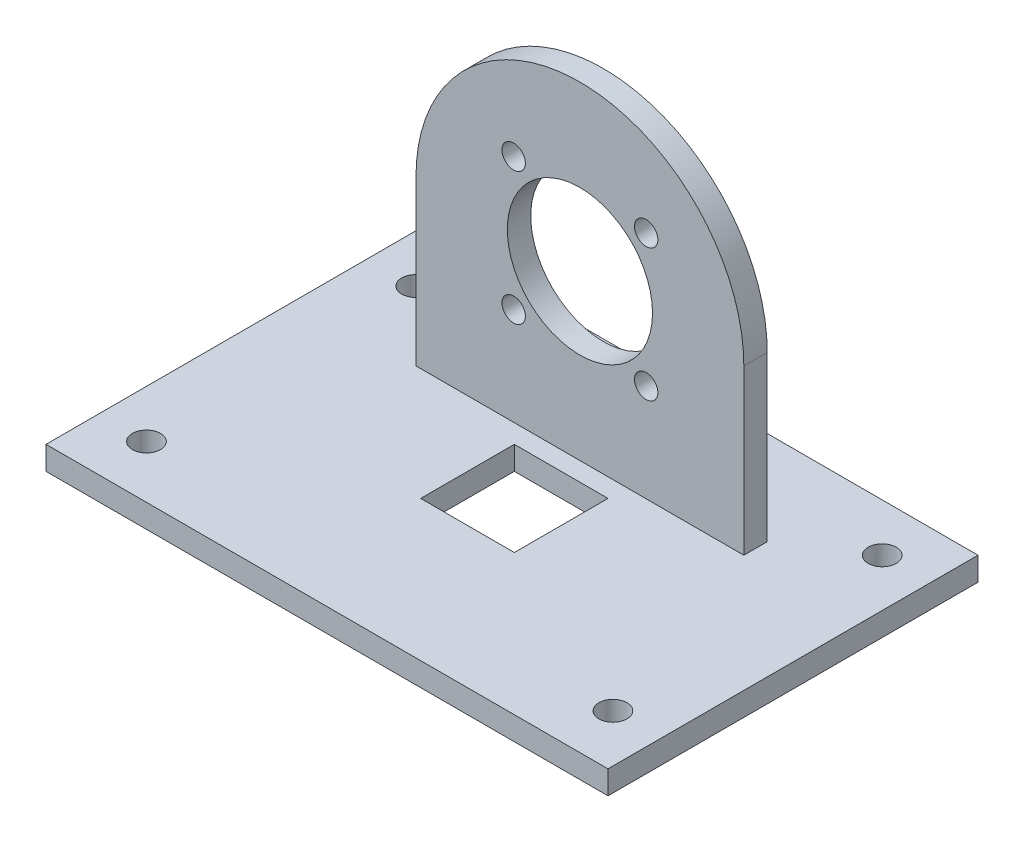
ISO-10303-21;
HEADER;
FILE_DESCRIPTION(('STEP AP214'),'2;1');
FILE_NAME('part.step','',(''),(''),'','','');
FILE_SCHEMA(('AUTOMOTIVE_DESIGN { 1 0 10303 214 1 1 1 1 }'));
ENDSEC;
DATA;
#1=APPLICATION_CONTEXT('core data for automotive mechanical design processes');
#2=APPLICATION_PROTOCOL_DEFINITION('international standard','automotive_design',2000,#1);
#3=PRODUCT_CONTEXT('',#1,'mechanical');
#4=PRODUCT('Part','Part','',(#3));
#5=PRODUCT_RELATED_PRODUCT_CATEGORY('part','',(#4));
#6=PRODUCT_DEFINITION_FORMATION('','',#4);
#7=PRODUCT_DEFINITION_CONTEXT('part definition',#1,'design');
#8=PRODUCT_DEFINITION('design','',#6,#7);
#9=PRODUCT_DEFINITION_SHAPE('','',#8);
#10=(LENGTH_UNIT() NAMED_UNIT(*) SI_UNIT(.MILLI.,.METRE.));
#11=(NAMED_UNIT(*) PLANE_ANGLE_UNIT() SI_UNIT($,.RADIAN.));
#12=(NAMED_UNIT(*) SI_UNIT($,.STERADIAN.) SOLID_ANGLE_UNIT());
#13=UNCERTAINTY_MEASURE_WITH_UNIT(LENGTH_MEASURE(1.E-05),#10,'distance_accuracy_value','');
#14=(GEOMETRIC_REPRESENTATION_CONTEXT(3) GLOBAL_UNCERTAINTY_ASSIGNED_CONTEXT((#13)) GLOBAL_UNIT_ASSIGNED_CONTEXT((#10,
#11,#12)) REPRESENTATION_CONTEXT('',''));
#15=CARTESIAN_POINT('',(0.,0.,0.));
#16=DIRECTION('',(0.,0.,1.));
#17=DIRECTION('',(1.,0.,0.));
#18=AXIS2_PLACEMENT_3D('',#15,#16,#17);
#19=CARTESIAN_POINT('',(-35.,75.,-14.));
#20=DIRECTION('',(0.,0.,-1.));
#21=DIRECTION('',(-1.,0.,0.));
#22=AXIS2_PLACEMENT_3D('',#19,#20,#21);
#23=PLANE('',#22);
#24=CARTESIAN_POINT('',(14.1421356237308,54.1421356237307,-14.));
#25=DIRECTION('',(0.,0.,-1.));
#26=DIRECTION('',(-1.,0.,0.));
#27=AXIS2_PLACEMENT_3D('',#24,#25,#26);
#28=CIRCLE('',#27,2.49999999999999);
#29=CARTESIAN_POINT('',(11.6421356237308,54.1421356237307,-14.));
#30=VERTEX_POINT('',#29);
#31=EDGE_CURVE('E606',#30,#30,#28,.F.);
#32=ORIENTED_EDGE('',*,*,#31,.F.);
#33=EDGE_LOOP('',(#32));
#34=FACE_BOUND('',#33,.T.);
#35=CARTESIAN_POINT('',(14.1421356237306,25.8578643762687,-14.));
#36=DIRECTION('',(0.,0.,-1.));
#37=DIRECTION('',(-1.,0.,0.));
#38=AXIS2_PLACEMENT_3D('',#35,#36,#37);
#39=CIRCLE('',#38,2.5);
#40=CARTESIAN_POINT('',(11.6421356237306,25.8578643762687,-14.));
#41=VERTEX_POINT('',#40);
#42=EDGE_CURVE('E616',#41,#41,#39,.F.);
#43=ORIENTED_EDGE('',*,*,#42,.F.);
#44=EDGE_LOOP('',(#43));
#45=FACE_BOUND('',#44,.T.);
#46=CARTESIAN_POINT('',(-14.1421356237313,25.857864376269,-14.));
#47=DIRECTION('',(0.,0.,-1.));
#48=DIRECTION('',(-1.,0.,0.));
#49=AXIS2_PLACEMENT_3D('',#46,#47,#48);
#50=CIRCLE('',#49,2.5);
#51=CARTESIAN_POINT('',(-16.6421356237313,25.857864376269,-14.));
#52=VERTEX_POINT('',#51);
#53=EDGE_CURVE('E622',#52,#52,#50,.F.);
#54=ORIENTED_EDGE('',*,*,#53,.F.);
#55=EDGE_LOOP('',(#54));
#56=FACE_BOUND('',#55,.T.);
#57=CARTESIAN_POINT('',(-14.1421356237309,54.142135623731,-14.));
#58=DIRECTION('',(0.,0.,-1.));
#59=DIRECTION('',(-1.,0.,0.));
#60=AXIS2_PLACEMENT_3D('',#57,#58,#59);
#61=CIRCLE('',#60,2.5);
#62=CARTESIAN_POINT('',(-16.6421356237309,54.142135623731,-14.));
#63=VERTEX_POINT('',#62);
#64=EDGE_CURVE('E165',#63,#63,#61,.F.);
#65=ORIENTED_EDGE('',*,*,#64,.F.);
#66=EDGE_LOOP('',(#65));
#67=FACE_BOUND('',#66,.T.);
#68=CARTESIAN_POINT('',(0.,40.,-14.));
#69=DIRECTION('',(0.,0.,1.));
#70=DIRECTION('',(1.,0.,0.));
#71=AXIS2_PLACEMENT_3D('',#68,#69,#70);
#72=CIRCLE('',#71,15.5);
#73=CARTESIAN_POINT('',(15.5,40.,-14.));
#74=VERTEX_POINT('',#73);
#75=EDGE_CURVE('E199',#74,#74,#72,.T.);
#76=ORIENTED_EDGE('',*,*,#75,.F.);
#77=EDGE_LOOP('',(#76));
#78=FACE_BOUND('',#77,.T.);
#79=CARTESIAN_POINT('',(0.,40.,-14.));
#80=DIRECTION('',(0.,0.,-1.));
#81=DIRECTION('',(-1.,0.,0.));
#82=AXIS2_PLACEMENT_3D('',#79,#80,#81);
#83=CIRCLE('',#82,35.0000000000001);
#84=CARTESIAN_POINT('',(-35.,40.0000023393455,-14.));
#85=VERTEX_POINT('',#84);
#86=CARTESIAN_POINT('',(35.,40.0000024370724,-14.));
#87=VERTEX_POINT('',#86);
#88=EDGE_CURVE('E210',#85,#87,#83,.T.);
#89=ORIENTED_EDGE('',*,*,#88,.F.);
#90=DIRECTION('',(0.,-1.,0.));
#91=VECTOR('',#90,1.);
#92=CARTESIAN_POINT('',(-35.,75.,-14.));
#93=LINE('',#92,#91);
#94=CARTESIAN_POINT('',(-35.,5.,-14.));
#95=VERTEX_POINT('',#94);
#96=EDGE_CURVE('E238',#85,#95,#93,.T.);
#97=ORIENTED_EDGE('',*,*,#96,.T.);
#98=DIRECTION('',(1.,0.,0.));
#99=VECTOR('',#98,1.);
#100=CARTESIAN_POINT('',(-35.,5.,-14.));
#101=LINE('',#100,#99);
#102=CARTESIAN_POINT('',(35.,5.,-14.));
#103=VERTEX_POINT('',#102);
#104=EDGE_CURVE('E217',#95,#103,#101,.T.);
#105=ORIENTED_EDGE('',*,*,#104,.T.);
#106=DIRECTION('',(0.,-1.,0.));
#107=VECTOR('',#106,1.);
#108=CARTESIAN_POINT('',(35.,75.,-14.));
#109=LINE('',#108,#107);
#110=EDGE_CURVE('E235',#87,#103,#109,.T.);
#111=ORIENTED_EDGE('',*,*,#110,.F.);
#112=EDGE_LOOP('',(#89,#97,#105,#111));
#113=FACE_BOUND('',#112,.T.);
#114=ADVANCED_FACE('F57',(#34,#45,#56,#67,#78,#113),#23,.F.);
#115=CARTESIAN_POINT('',(-35.,75.,-19.));
#116=DIRECTION('',(0.,0.,1.));
#117=DIRECTION('',(1.,0.,0.));
#118=AXIS2_PLACEMENT_3D('',#115,#116,#117);
#119=PLANE('',#118);
#120=CARTESIAN_POINT('',(14.1421356237308,54.1421356237307,-19.));
#121=DIRECTION('',(0.,0.,-1.));
#122=DIRECTION('',(-1.,0.,0.));
#123=AXIS2_PLACEMENT_3D('',#120,#121,#122);
#124=CIRCLE('',#123,2.49999999999999);
#125=CARTESIAN_POINT('',(11.6421356237308,54.1421356237307,-19.));
#126=VERTEX_POINT('',#125);
#127=EDGE_CURVE('E609',#126,#126,#124,.T.);
#128=ORIENTED_EDGE('',*,*,#127,.F.);
#129=EDGE_LOOP('',(#128));
#130=FACE_BOUND('',#129,.T.);
#131=CARTESIAN_POINT('',(14.1421356237306,25.8578643762687,-19.));
#132=DIRECTION('',(0.,0.,-1.));
#133=DIRECTION('',(-1.,0.,0.));
#134=AXIS2_PLACEMENT_3D('',#131,#132,#133);
#135=CIRCLE('',#134,2.5);
#136=CARTESIAN_POINT('',(11.6421356237306,25.8578643762687,-19.));
#137=VERTEX_POINT('',#136);
#138=EDGE_CURVE('E613',#137,#137,#135,.T.);
#139=ORIENTED_EDGE('',*,*,#138,.F.);
#140=EDGE_LOOP('',(#139));
#141=FACE_BOUND('',#140,.T.);
#142=CARTESIAN_POINT('',(-14.1421356237313,25.857864376269,-19.));
#143=DIRECTION('',(0.,0.,-1.));
#144=DIRECTION('',(-1.,0.,0.));
#145=AXIS2_PLACEMENT_3D('',#142,#143,#144);
#146=CIRCLE('',#145,2.5);
#147=CARTESIAN_POINT('',(-16.6421356237313,25.857864376269,-19.));
#148=VERTEX_POINT('',#147);
#149=EDGE_CURVE('E640',#148,#148,#146,.T.);
#150=ORIENTED_EDGE('',*,*,#149,.F.);
#151=EDGE_LOOP('',(#150));
#152=FACE_BOUND('',#151,.T.);
#153=CARTESIAN_POINT('',(-14.1421356237309,54.142135623731,-19.));
#154=DIRECTION('',(0.,0.,-1.));
#155=DIRECTION('',(-1.,0.,0.));
#156=AXIS2_PLACEMENT_3D('',#153,#154,#155);
#157=CIRCLE('',#156,2.5);
#158=CARTESIAN_POINT('',(-16.6421356237309,54.142135623731,-19.));
#159=VERTEX_POINT('',#158);
#160=EDGE_CURVE('E619',#159,#159,#157,.T.);
#161=ORIENTED_EDGE('',*,*,#160,.F.);
#162=EDGE_LOOP('',(#161));
#163=FACE_BOUND('',#162,.T.);
#164=CARTESIAN_POINT('',(0.,40.,-19.));
#165=DIRECTION('',(0.,0.,1.));
#166=DIRECTION('',(1.,0.,0.));
#167=AXIS2_PLACEMENT_3D('',#164,#165,#166);
#168=CIRCLE('',#167,15.5);
#169=CARTESIAN_POINT('',(15.5,40.,-19.));
#170=VERTEX_POINT('',#169);
#171=EDGE_CURVE('E61',#170,#170,#168,.T.);
#172=ORIENTED_EDGE('',*,*,#171,.T.);
#173=EDGE_LOOP('',(#172));
#174=FACE_BOUND('',#173,.T.);
#175=DIRECTION('',(0.,-1.,0.));
#176=VECTOR('',#175,1.);
#177=CARTESIAN_POINT('',(-35.,75.,-19.));
#178=LINE('',#177,#176);
#179=CARTESIAN_POINT('',(-35.,40.0000023393455,-19.));
#180=VERTEX_POINT('',#179);
#181=CARTESIAN_POINT('',(-35.,5.,-19.));
#182=VERTEX_POINT('',#181);
#183=EDGE_CURVE('E229',#180,#182,#178,.T.);
#184=ORIENTED_EDGE('',*,*,#183,.F.);
#185=CARTESIAN_POINT('',(0.,40.,-19.));
#186=DIRECTION('',(0.,0.,-1.));
#187=DIRECTION('',(-1.,0.,0.));
#188=AXIS2_PLACEMENT_3D('',#185,#186,#187);
#189=CIRCLE('',#188,35.0000000000001);
#190=CARTESIAN_POINT('',(35.,40.0000024370724,-19.));
#191=VERTEX_POINT('',#190);
#192=EDGE_CURVE('E203',#180,#191,#189,.T.);
#193=ORIENTED_EDGE('',*,*,#192,.T.);
#194=DIRECTION('',(0.,-1.,0.));
#195=VECTOR('',#194,1.);
#196=CARTESIAN_POINT('',(35.,75.,-19.));
#197=LINE('',#196,#195);
#198=CARTESIAN_POINT('',(35.,5.,-19.));
#199=VERTEX_POINT('',#198);
#200=EDGE_CURVE('E232',#191,#199,#197,.T.);
#201=ORIENTED_EDGE('',*,*,#200,.T.);
#202=DIRECTION('',(-1.,0.,0.));
#203=VECTOR('',#202,1.);
#204=CARTESIAN_POINT('',(-35.,5.,-19.));
#205=LINE('',#204,#203);
#206=EDGE_CURVE('E225',#199,#182,#205,.T.);
#207=ORIENTED_EDGE('',*,*,#206,.T.);
#208=EDGE_LOOP('',(#184,#193,#201,#207));
#209=FACE_BOUND('',#208,.T.);
#210=ADVANCED_FACE('F346',(#130,#141,#152,#163,#174,#209),#119,.F.);
#211=CARTESIAN_POINT('',(35.,75.,-14.));
#212=DIRECTION('',(-1.,0.,0.));
#213=DIRECTION('',(0.,0.,1.));
#214=AXIS2_PLACEMENT_3D('',#211,#212,#213);
#215=PLANE('',#214);
#216=DIRECTION('',(0.,0.,-1.));
#217=VECTOR('',#216,1.);
#218=CARTESIAN_POINT('',(35.,40.0000024370724,0.999999999999997));
#219=LINE('',#218,#217);
#220=EDGE_CURVE('E207',#87,#191,#219,.T.);
#221=ORIENTED_EDGE('',*,*,#220,.F.);
#222=ORIENTED_EDGE('',*,*,#110,.T.);
#223=DIRECTION('',(0.,0.,-1.));
#224=VECTOR('',#223,1.);
#225=CARTESIAN_POINT('',(35.,5.,-14.));
#226=LINE('',#225,#224);
#227=EDGE_CURVE('E221',#103,#199,#226,.T.);
#228=ORIENTED_EDGE('',*,*,#227,.T.);
#229=ORIENTED_EDGE('',*,*,#200,.F.);
#230=EDGE_LOOP('',(#221,#222,#228,#229));
#231=FACE_BOUND('',#230,.T.);
#232=ADVANCED_FACE('F335',(#231),#215,.F.);
#233=CARTESIAN_POINT('',(0.,5.,0.));
#234=DIRECTION('',(0.,-1.,0.));
#235=DIRECTION('',(0.,0.,-1.));
#236=AXIS2_PLACEMENT_3D('',#233,#234,#235);
#237=PLANE('',#236);
#238=DIRECTION('',(0.,0.,1.));
#239=VECTOR('',#238,1.);
#240=CARTESIAN_POINT('',(10.,5.,0.));
#241=LINE('',#240,#239);
#242=CARTESIAN_POINT('',(10.,5.,-10.));
#243=VERTEX_POINT('',#242);
#244=CARTESIAN_POINT('',(10.,5.,9.99999999999999));
#245=VERTEX_POINT('',#244);
#246=EDGE_CURVE('E181',#243,#245,#241,.T.);
#247=ORIENTED_EDGE('',*,*,#246,.T.);
#248=DIRECTION('',(-1.,0.,0.));
#249=VECTOR('',#248,1.);
#250=CARTESIAN_POINT('',(0.,5.,9.99999999999999));
#251=LINE('',#250,#249);
#252=CARTESIAN_POINT('',(-9.99999999999999,5.,9.99999999999999));
#253=VERTEX_POINT('',#252);
#254=EDGE_CURVE('E154',#245,#253,#251,.T.);
#255=ORIENTED_EDGE('',*,*,#254,.T.);
#256=DIRECTION('',(0.,0.,-1.));
#257=VECTOR('',#256,1.);
#258=CARTESIAN_POINT('',(-9.99999999999999,5.,0.));
#259=LINE('',#258,#257);
#260=CARTESIAN_POINT('',(-9.99999999999999,5.,-10.));
#261=VERTEX_POINT('',#260);
#262=EDGE_CURVE('E193',#253,#261,#259,.T.);
#263=ORIENTED_EDGE('',*,*,#262,.T.);
#264=DIRECTION('',(1.,0.,0.));
#265=VECTOR('',#264,1.);
#266=CARTESIAN_POINT('',(0.,5.,-10.));
#267=LINE('',#266,#265);
#268=EDGE_CURVE('E189',#261,#243,#267,.T.);
#269=ORIENTED_EDGE('',*,*,#268,.T.);
#270=EDGE_LOOP('',(#247,#255,#263,#269));
#271=FACE_BOUND('',#270,.T.);
#272=CARTESIAN_POINT('',(-49.7964607176049,5.,-28.7500000000006));
#273=DIRECTION('',(0.,1.,0.));
#274=DIRECTION('',(0.,0.,1.));
#275=AXIS2_PLACEMENT_3D('',#272,#273,#274);
#276=CIRCLE('',#275,3.);
#277=CARTESIAN_POINT('',(-49.7964607176049,5.,-25.7500000000006));
#278=VERTEX_POINT('',#277);
#279=EDGE_CURVE('E242',#278,#278,#276,.T.);
#280=ORIENTED_EDGE('',*,*,#279,.F.);
#281=EDGE_LOOP('',(#280));
#282=FACE_BOUND('',#281,.T.);
#283=CARTESIAN_POINT('',(-49.7964607176015,5.,28.7500000000021));
#284=DIRECTION('',(0.,1.,0.));
#285=DIRECTION('',(0.,0.,1.));
#286=AXIS2_PLACEMENT_3D('',#283,#284,#285);
#287=CIRCLE('',#286,3.);
#288=CARTESIAN_POINT('',(-49.7964607176015,5.,31.7500000000021));
#289=VERTEX_POINT('',#288);
#290=EDGE_CURVE('E250',#289,#289,#287,.T.);
#291=ORIENTED_EDGE('',*,*,#290,.F.);
#292=EDGE_LOOP('',(#291));
#293=FACE_BOUND('',#292,.T.);
#294=CARTESIAN_POINT('',(49.7964607176089,5.,28.7499999999979));
#295=DIRECTION('',(0.,1.,0.));
#296=DIRECTION('',(0.,0.,1.));
#297=AXIS2_PLACEMENT_3D('',#294,#295,#296);
#298=CIRCLE('',#297,3.);
#299=CARTESIAN_POINT('',(49.7964607176089,5.,31.7499999999979));
#300=VERTEX_POINT('',#299);
#301=EDGE_CURVE('E258',#300,#300,#298,.T.);
#302=ORIENTED_EDGE('',*,*,#301,.F.);
#303=EDGE_LOOP('',(#302));
#304=FACE_BOUND('',#303,.T.);
#305=CARTESIAN_POINT('',(49.7964607176053,5.,-28.7499999999999));
#306=DIRECTION('',(0.,1.,0.));
#307=DIRECTION('',(0.,0.,1.));
#308=AXIS2_PLACEMENT_3D('',#305,#306,#307);
#309=CIRCLE('',#308,3.);
#310=CARTESIAN_POINT('',(49.7964607176053,5.,-25.7499999999999));
#311=VERTEX_POINT('',#310);
#312=EDGE_CURVE('E266',#311,#311,#309,.T.);
#313=ORIENTED_EDGE('',*,*,#312,.F.);
#314=EDGE_LOOP('',(#313));
#315=FACE_BOUND('',#314,.T.);
#316=DIRECTION('',(1.,0.,0.));
#317=VECTOR('',#316,1.);
#318=CARTESIAN_POINT('',(-35.,5.,40.));
#319=LINE('',#318,#317);
#320=CARTESIAN_POINT('',(-60.,5.,40.));
#321=VERTEX_POINT('',#320);
#322=CARTESIAN_POINT('',(60.,5.,40.));
#323=VERTEX_POINT('',#322);
#324=EDGE_CURVE('E278',#321,#323,#319,.T.);
#325=ORIENTED_EDGE('',*,*,#324,.T.);
#326=DIRECTION('',(0.,0.,-1.));
#327=VECTOR('',#326,1.);
#328=CARTESIAN_POINT('',(60.,5.,-39.));
#329=LINE('',#328,#327);
#330=CARTESIAN_POINT('',(60.,5.,-39.));
#331=VERTEX_POINT('',#330);
#332=EDGE_CURVE('E282',#323,#331,#329,.T.);
#333=ORIENTED_EDGE('',*,*,#332,.T.);
#334=DIRECTION('',(-1.,0.,0.));
#335=VECTOR('',#334,1.);
#336=CARTESIAN_POINT('',(-60.,5.,-39.));
#337=LINE('',#336,#335);
#338=CARTESIAN_POINT('',(-60.,5.,-39.));
#339=VERTEX_POINT('',#338);
#340=EDGE_CURVE('E285',#331,#339,#337,.T.);
#341=ORIENTED_EDGE('',*,*,#340,.T.);
#342=DIRECTION('',(0.,0.,1.));
#343=VECTOR('',#342,1.);
#344=CARTESIAN_POINT('',(-60.,5.,40.));
#345=LINE('',#344,#343);
#346=EDGE_CURVE('E274',#339,#321,#345,.T.);
#347=ORIENTED_EDGE('',*,*,#346,.T.);
#348=EDGE_LOOP('',(#325,#333,#341,#347));
#349=FACE_BOUND('',#348,.T.);
#350=DIRECTION('',(0.,0.,1.));
#351=VECTOR('',#350,1.);
#352=CARTESIAN_POINT('',(-35.,5.,-19.));
#353=LINE('',#352,#351);
#354=EDGE_CURVE('E213',#182,#95,#353,.T.);
#355=ORIENTED_EDGE('',*,*,#354,.F.);
#356=ORIENTED_EDGE('',*,*,#206,.F.);
#357=ORIENTED_EDGE('',*,*,#227,.F.);
#358=ORIENTED_EDGE('',*,*,#104,.F.);
#359=EDGE_LOOP('',(#355,#356,#357,#358));
#360=FACE_BOUND('',#359,.T.);
#361=ADVANCED_FACE('F332',(#271,#282,#293,#304,#315,#349,#360),#237,.F.);
#362=CARTESIAN_POINT('',(0.,0.,0.));
#363=DIRECTION('',(0.,-1.,0.));
#364=DIRECTION('',(0.,0.,-1.));
#365=AXIS2_PLACEMENT_3D('',#362,#363,#364);
#366=PLANE('',#365);
#367=DIRECTION('',(1.,0.,0.));
#368=VECTOR('',#367,1.);
#369=CARTESIAN_POINT('',(60.,0.,40.));
#370=LINE('',#369,#368);
#371=CARTESIAN_POINT('',(-60.,0.,40.));
#372=VERTEX_POINT('',#371);
#373=CARTESIAN_POINT('',(60.,0.,40.));
#374=VERTEX_POINT('',#373);
#375=EDGE_CURVE('E292',#372,#374,#370,.T.);
#376=ORIENTED_EDGE('',*,*,#375,.F.);
#377=DIRECTION('',(0.,0.,1.));
#378=VECTOR('',#377,1.);
#379=CARTESIAN_POINT('',(-60.,0.,40.));
#380=LINE('',#379,#378);
#381=CARTESIAN_POINT('',(-60.,0.,-39.));
#382=VERTEX_POINT('',#381);
#383=EDGE_CURVE('E270',#382,#372,#380,.T.);
#384=ORIENTED_EDGE('',*,*,#383,.F.);
#385=DIRECTION('',(-1.,0.,0.));
#386=VECTOR('',#385,1.);
#387=CARTESIAN_POINT('',(-60.,0.,-39.));
#388=LINE('',#387,#386);
#389=CARTESIAN_POINT('',(60.,0.,-39.));
#390=VERTEX_POINT('',#389);
#391=EDGE_CURVE('E279',#390,#382,#388,.T.);
#392=ORIENTED_EDGE('',*,*,#391,.F.);
#393=DIRECTION('',(0.,0.,-1.));
#394=VECTOR('',#393,1.);
#395=CARTESIAN_POINT('',(60.,0.,-39.));
#396=LINE('',#395,#394);
#397=EDGE_CURVE('E295',#374,#390,#396,.T.);
#398=ORIENTED_EDGE('',*,*,#397,.F.);
#399=EDGE_LOOP('',(#376,#384,#392,#398));
#400=FACE_BOUND('',#399,.T.);
#401=DIRECTION('',(-1.,0.,0.));
#402=VECTOR('',#401,1.);
#403=CARTESIAN_POINT('',(-9.99999999999999,0.,9.99999999999999));
#404=LINE('',#403,#402);
#405=CARTESIAN_POINT('',(10.,0.,9.99999999999999));
#406=VERTEX_POINT('',#405);
#407=CARTESIAN_POINT('',(-9.99999999999999,0.,9.99999999999999));
#408=VERTEX_POINT('',#407);
#409=EDGE_CURVE('E151',#406,#408,#404,.T.);
#410=ORIENTED_EDGE('',*,*,#409,.F.);
#411=DIRECTION('',(0.,0.,1.));
#412=VECTOR('',#411,1.);
#413=CARTESIAN_POINT('',(10.,0.,-10.));
#414=LINE('',#413,#412);
#415=CARTESIAN_POINT('',(10.,0.,-10.));
#416=VERTEX_POINT('',#415);
#417=EDGE_CURVE('E160',#416,#406,#414,.T.);
#418=ORIENTED_EDGE('',*,*,#417,.F.);
#419=DIRECTION('',(1.,0.,0.));
#420=VECTOR('',#419,1.);
#421=CARTESIAN_POINT('',(-9.99999999999999,0.,-10.));
#422=LINE('',#421,#420);
#423=CARTESIAN_POINT('',(-9.99999999999999,0.,-10.));
#424=VERTEX_POINT('',#423);
#425=EDGE_CURVE('E82',#424,#416,#422,.T.);
#426=ORIENTED_EDGE('',*,*,#425,.F.);
#427=DIRECTION('',(0.,0.,-1.));
#428=VECTOR('',#427,1.);
#429=CARTESIAN_POINT('',(-9.99999999999999,0.,-10.));
#430=LINE('',#429,#428);
#431=EDGE_CURVE('E170',#408,#424,#430,.T.);
#432=ORIENTED_EDGE('',*,*,#431,.F.);
#433=EDGE_LOOP('',(#410,#418,#426,#432));
#434=FACE_BOUND('',#433,.T.);
#435=CARTESIAN_POINT('',(-49.7964607176015,0.,28.7500000000021));
#436=DIRECTION('',(0.,1.,0.));
#437=DIRECTION('',(0.,0.,1.));
#438=AXIS2_PLACEMENT_3D('',#435,#436,#437);
#439=CIRCLE('',#438,3.);
#440=CARTESIAN_POINT('',(-49.7964607176015,0.,31.7500000000021));
#441=VERTEX_POINT('',#440);
#442=EDGE_CURVE('E246',#441,#441,#439,.T.);
#443=ORIENTED_EDGE('',*,*,#442,.T.);
#444=EDGE_LOOP('',(#443));
#445=FACE_BOUND('',#444,.T.);
#446=CARTESIAN_POINT('',(49.7964607176089,0.,28.7499999999979));
#447=DIRECTION('',(0.,1.,0.));
#448=DIRECTION('',(0.,0.,1.));
#449=AXIS2_PLACEMENT_3D('',#446,#447,#448);
#450=CIRCLE('',#449,3.);
#451=CARTESIAN_POINT('',(49.7964607176089,0.,31.7499999999979));
#452=VERTEX_POINT('',#451);
#453=EDGE_CURVE('E254',#452,#452,#450,.T.);
#454=ORIENTED_EDGE('',*,*,#453,.T.);
#455=EDGE_LOOP('',(#454));
#456=FACE_BOUND('',#455,.T.);
#457=CARTESIAN_POINT('',(49.7964607176053,0.,-28.7499999999999));
#458=DIRECTION('',(0.,1.,0.));
#459=DIRECTION('',(0.,0.,1.));
#460=AXIS2_PLACEMENT_3D('',#457,#458,#459);
#461=CIRCLE('',#460,3.);
#462=CARTESIAN_POINT('',(49.7964607176053,0.,-25.7499999999999));
#463=VERTEX_POINT('',#462);
#464=EDGE_CURVE('E262',#463,#463,#461,.T.);
#465=ORIENTED_EDGE('',*,*,#464,.T.);
#466=EDGE_LOOP('',(#465));
#467=FACE_BOUND('',#466,.T.);
#468=CARTESIAN_POINT('',(-49.7964607176049,0.,-28.7500000000006));
#469=DIRECTION('',(0.,1.,0.));
#470=DIRECTION('',(0.,0.,1.));
#471=AXIS2_PLACEMENT_3D('',#468,#469,#470);
#472=CIRCLE('',#471,3.);
#473=CARTESIAN_POINT('',(-49.7964607176049,0.,-25.7500000000006));
#474=VERTEX_POINT('',#473);
#475=EDGE_CURVE('E241',#474,#474,#472,.T.);
#476=ORIENTED_EDGE('',*,*,#475,.T.);
#477=EDGE_LOOP('',(#476));
#478=FACE_BOUND('',#477,.T.);
#479=ADVANCED_FACE('F167',(#400,#434,#445,#456,#467,#478),#366,.T.);
#480=CARTESIAN_POINT('',(-60.,5.,40.));
#481=DIRECTION('',(1.,0.,0.));
#482=DIRECTION('',(0.,0.,-1.));
#483=AXIS2_PLACEMENT_3D('',#480,#481,#482);
#484=PLANE('',#483);
#485=ORIENTED_EDGE('',*,*,#383,.T.);
#486=DIRECTION('',(0.,-1.,0.));
#487=VECTOR('',#486,1.);
#488=CARTESIAN_POINT('',(-60.,5.,40.));
#489=LINE('',#488,#487);
#490=EDGE_CURVE('E67',#321,#372,#489,.T.);
#491=ORIENTED_EDGE('',*,*,#490,.F.);
#492=ORIENTED_EDGE('',*,*,#346,.F.);
#493=DIRECTION('',(0.,-1.,0.));
#494=VECTOR('',#493,1.);
#495=CARTESIAN_POINT('',(-60.,5.,-39.));
#496=LINE('',#495,#494);
#497=EDGE_CURVE('E288',#339,#382,#496,.T.);
#498=ORIENTED_EDGE('',*,*,#497,.T.);
#499=EDGE_LOOP('',(#485,#491,#492,#498));
#500=FACE_BOUND('',#499,.T.);
#501=ADVANCED_FACE('F59',(#500),#484,.F.);
#502=CARTESIAN_POINT('',(60.,5.,40.));
#503=DIRECTION('',(0.,0.,-1.));
#504=DIRECTION('',(-1.,0.,0.));
#505=AXIS2_PLACEMENT_3D('',#502,#503,#504);
#506=PLANE('',#505);
#507=ORIENTED_EDGE('',*,*,#375,.T.);
#508=DIRECTION('',(0.,-1.,0.));
#509=VECTOR('',#508,1.);
#510=CARTESIAN_POINT('',(60.,5.,40.));
#511=LINE('',#510,#509);
#512=EDGE_CURVE('E307',#323,#374,#511,.T.);
#513=ORIENTED_EDGE('',*,*,#512,.F.);
#514=ORIENTED_EDGE('',*,*,#324,.F.);
#515=ORIENTED_EDGE('',*,*,#490,.T.);
#516=EDGE_LOOP('',(#507,#513,#514,#515));
#517=FACE_BOUND('',#516,.T.);
#518=ADVANCED_FACE('F315',(#517),#506,.F.);
#519=CARTESIAN_POINT('',(60.,5.,-39.));
#520=DIRECTION('',(-1.,0.,0.));
#521=DIRECTION('',(0.,0.,1.));
#522=AXIS2_PLACEMENT_3D('',#519,#520,#521);
#523=PLANE('',#522);
#524=ORIENTED_EDGE('',*,*,#397,.T.);
#525=DIRECTION('',(0.,-1.,0.));
#526=VECTOR('',#525,1.);
#527=CARTESIAN_POINT('',(60.,5.,-39.));
#528=LINE('',#527,#526);
#529=EDGE_CURVE('E303',#331,#390,#528,.T.);
#530=ORIENTED_EDGE('',*,*,#529,.F.);
#531=ORIENTED_EDGE('',*,*,#332,.F.);
#532=ORIENTED_EDGE('',*,*,#512,.T.);
#533=EDGE_LOOP('',(#524,#530,#531,#532));
#534=FACE_BOUND('',#533,.T.);
#535=ADVANCED_FACE('F326',(#534),#523,.F.);
#536=CARTESIAN_POINT('',(-60.,5.,-39.));
#537=DIRECTION('',(0.,0.,1.));
#538=DIRECTION('',(1.,0.,0.));
#539=AXIS2_PLACEMENT_3D('',#536,#537,#538);
#540=PLANE('',#539);
#541=ORIENTED_EDGE('',*,*,#391,.T.);
#542=ORIENTED_EDGE('',*,*,#497,.F.);
#543=ORIENTED_EDGE('',*,*,#340,.F.);
#544=ORIENTED_EDGE('',*,*,#529,.T.);
#545=EDGE_LOOP('',(#541,#542,#543,#544));
#546=FACE_BOUND('',#545,.T.);
#547=ADVANCED_FACE('F330',(#546),#540,.F.);
#548=CARTESIAN_POINT('',(49.7964607176053,5.,-28.7499999999999));
#549=DIRECTION('',(0.,-1.,0.));
#550=DIRECTION('',(0.,0.,-1.));
#551=AXIS2_PLACEMENT_3D('',#548,#549,#550);
#552=CYLINDRICAL_SURFACE('',#551,3.);
#553=ORIENTED_EDGE('',*,*,#312,.T.);
#554=EDGE_LOOP('',(#553));
#555=FACE_BOUND('',#554,.T.);
#556=ORIENTED_EDGE('',*,*,#464,.F.);
#557=EDGE_LOOP('',(#556));
#558=FACE_BOUND('',#557,.T.);
#559=ADVANCED_FACE('F389',(#555,#558),#552,.F.);
#560=CARTESIAN_POINT('',(49.7964607176089,5.,28.7499999999979));
#561=DIRECTION('',(0.,-1.,0.));
#562=DIRECTION('',(0.,0.,-1.));
#563=AXIS2_PLACEMENT_3D('',#560,#561,#562);
#564=CYLINDRICAL_SURFACE('',#563,3.);
#565=ORIENTED_EDGE('',*,*,#301,.T.);
#566=EDGE_LOOP('',(#565));
#567=FACE_BOUND('',#566,.T.);
#568=ORIENTED_EDGE('',*,*,#453,.F.);
#569=EDGE_LOOP('',(#568));
#570=FACE_BOUND('',#569,.T.);
#571=ADVANCED_FACE('F385',(#567,#570),#564,.F.);
#572=CARTESIAN_POINT('',(-49.7964607176015,5.,28.7500000000021));
#573=DIRECTION('',(0.,-1.,0.));
#574=DIRECTION('',(0.,0.,-1.));
#575=AXIS2_PLACEMENT_3D('',#572,#573,#574);
#576=CYLINDRICAL_SURFACE('',#575,3.);
#577=ORIENTED_EDGE('',*,*,#290,.T.);
#578=EDGE_LOOP('',(#577));
#579=FACE_BOUND('',#578,.T.);
#580=ORIENTED_EDGE('',*,*,#442,.F.);
#581=EDGE_LOOP('',(#580));
#582=FACE_BOUND('',#581,.T.);
#583=ADVANCED_FACE('F381',(#579,#582),#576,.F.);
#584=CARTESIAN_POINT('',(-49.7964607176049,5.,-28.7500000000006));
#585=DIRECTION('',(0.,-1.,0.));
#586=DIRECTION('',(0.,0.,-1.));
#587=AXIS2_PLACEMENT_3D('',#584,#585,#586);
#588=CYLINDRICAL_SURFACE('',#587,3.);
#589=ORIENTED_EDGE('',*,*,#279,.T.);
#590=EDGE_LOOP('',(#589));
#591=FACE_BOUND('',#590,.T.);
#592=ORIENTED_EDGE('',*,*,#475,.F.);
#593=EDGE_LOOP('',(#592));
#594=FACE_BOUND('',#593,.T.);
#595=ADVANCED_FACE('F365',(#591,#594),#588,.F.);
#596=CARTESIAN_POINT('',(-35.,75.,-19.));
#597=DIRECTION('',(1.,0.,0.));
#598=DIRECTION('',(0.,0.,-1.));
#599=AXIS2_PLACEMENT_3D('',#596,#597,#598);
#600=PLANE('',#599);
#601=ORIENTED_EDGE('',*,*,#96,.F.);
#602=DIRECTION('',(0.,0.,-1.));
#603=VECTOR('',#602,1.);
#604=CARTESIAN_POINT('',(-35.,40.,0.999999999999997));
#605=LINE('',#604,#603);
#606=EDGE_CURVE('E12',#85,#180,#605,.T.);
#607=ORIENTED_EDGE('',*,*,#606,.T.);
#608=ORIENTED_EDGE('',*,*,#183,.T.);
#609=ORIENTED_EDGE('',*,*,#354,.T.);
#610=EDGE_LOOP('',(#601,#607,#608,#609));
#611=FACE_BOUND('',#610,.T.);
#612=ADVANCED_FACE('F353',(#611),#600,.F.);
#613=CARTESIAN_POINT('',(0.,40.,0.999999999999997));
#614=DIRECTION('',(0.,0.,-1.));
#615=DIRECTION('',(-1.,0.,0.));
#616=AXIS2_PLACEMENT_3D('',#613,#614,#615);
#617=CYLINDRICAL_SURFACE('',#616,35.0000000000001);
#618=ORIENTED_EDGE('',*,*,#88,.T.);
#619=ORIENTED_EDGE('',*,*,#220,.T.);
#620=ORIENTED_EDGE('',*,*,#192,.F.);
#621=ORIENTED_EDGE('',*,*,#606,.F.);
#622=EDGE_LOOP('',(#618,#619,#620,#621));
#623=FACE_BOUND('',#622,.T.);
#624=ADVANCED_FACE('F355',(#623),#617,.T.);
#625=CARTESIAN_POINT('',(0.,40.,-24.));
#626=DIRECTION('',(0.,0.,1.));
#627=DIRECTION('',(1.,0.,0.));
#628=AXIS2_PLACEMENT_3D('',#625,#626,#627);
#629=CYLINDRICAL_SURFACE('',#628,15.5);
#630=ORIENTED_EDGE('',*,*,#75,.T.);
#631=EDGE_LOOP('',(#630));
#632=FACE_BOUND('',#631,.T.);
#633=ORIENTED_EDGE('',*,*,#171,.F.);
#634=EDGE_LOOP('',(#633));
#635=FACE_BOUND('',#634,.T.);
#636=ADVANCED_FACE('F357',(#632,#635),#629,.F.);
#637=CARTESIAN_POINT('',(-9.99999999999999,75.0010000000001,9.99999999999999));
#638=DIRECTION('',(0.,0.,1.));
#639=DIRECTION('',(1.,0.,0.));
#640=AXIS2_PLACEMENT_3D('',#637,#638,#639);
#641=PLANE('',#640);
#642=DIRECTION('',(0.,-1.,0.));
#643=VECTOR('',#642,1.);
#644=CARTESIAN_POINT('',(10.,75.0010000000001,9.99999999999999));
#645=LINE('',#644,#643);
#646=EDGE_CURVE('E74',#245,#406,#645,.T.);
#647=ORIENTED_EDGE('',*,*,#646,.T.);
#648=ORIENTED_EDGE('',*,*,#409,.T.);
#649=DIRECTION('',(0.,-1.,0.));
#650=VECTOR('',#649,1.);
#651=CARTESIAN_POINT('',(-9.99999999999999,75.0010000000001,9.99999999999999));
#652=LINE('',#651,#650);
#653=EDGE_CURVE('E157',#253,#408,#652,.T.);
#654=ORIENTED_EDGE('',*,*,#653,.F.);
#655=ORIENTED_EDGE('',*,*,#254,.F.);
#656=EDGE_LOOP('',(#647,#648,#654,#655));
#657=FACE_BOUND('',#656,.T.);
#658=ADVANCED_FACE('F148',(#657),#641,.F.);
#659=CARTESIAN_POINT('',(-9.99999999999999,75.0010000000001,-10.));
#660=DIRECTION('',(-1.,0.,0.));
#661=DIRECTION('',(0.,0.,1.));
#662=AXIS2_PLACEMENT_3D('',#659,#660,#661);
#663=PLANE('',#662);
#664=ORIENTED_EDGE('',*,*,#653,.T.);
#665=ORIENTED_EDGE('',*,*,#431,.T.);
#666=DIRECTION('',(0.,-1.,0.));
#667=VECTOR('',#666,1.);
#668=CARTESIAN_POINT('',(-9.99999999999999,75.0010000000001,-10.));
#669=LINE('',#668,#667);
#670=EDGE_CURVE('E182',#261,#424,#669,.T.);
#671=ORIENTED_EDGE('',*,*,#670,.F.);
#672=ORIENTED_EDGE('',*,*,#262,.F.);
#673=EDGE_LOOP('',(#664,#665,#671,#672));
#674=FACE_BOUND('',#673,.T.);
#675=ADVANCED_FACE('F480',(#674),#663,.F.);
#676=CARTESIAN_POINT('',(-9.99999999999999,75.0010000000001,-10.));
#677=DIRECTION('',(0.,0.,-1.));
#678=DIRECTION('',(-1.,0.,0.));
#679=AXIS2_PLACEMENT_3D('',#676,#677,#678);
#680=PLANE('',#679);
#681=ORIENTED_EDGE('',*,*,#670,.T.);
#682=ORIENTED_EDGE('',*,*,#425,.T.);
#683=DIRECTION('',(0.,-1.,0.));
#684=VECTOR('',#683,1.);
#685=CARTESIAN_POINT('',(10.,75.0010000000001,-10.));
#686=LINE('',#685,#684);
#687=EDGE_CURVE('E162',#243,#416,#686,.T.);
#688=ORIENTED_EDGE('',*,*,#687,.F.);
#689=ORIENTED_EDGE('',*,*,#268,.F.);
#690=EDGE_LOOP('',(#681,#682,#688,#689));
#691=FACE_BOUND('',#690,.T.);
#692=ADVANCED_FACE('F477',(#691),#680,.F.);
#693=CARTESIAN_POINT('',(10.,75.0010000000001,-10.));
#694=DIRECTION('',(1.,0.,0.));
#695=DIRECTION('',(0.,0.,-1.));
#696=AXIS2_PLACEMENT_3D('',#693,#694,#695);
#697=PLANE('',#696);
#698=ORIENTED_EDGE('',*,*,#687,.T.);
#699=ORIENTED_EDGE('',*,*,#417,.T.);
#700=ORIENTED_EDGE('',*,*,#646,.F.);
#701=ORIENTED_EDGE('',*,*,#246,.F.);
#702=EDGE_LOOP('',(#698,#699,#700,#701));
#703=FACE_BOUND('',#702,.T.);
#704=ADVANCED_FACE('F161',(#703),#697,.F.);
#705=CARTESIAN_POINT('',(-14.1421356237309,54.142135623731,-6.92893218813452));
#706=DIRECTION('',(0.,0.,-1.));
#707=DIRECTION('',(-1.,0.,0.));
#708=AXIS2_PLACEMENT_3D('',#705,#706,#707);
#709=CYLINDRICAL_SURFACE('',#708,2.5);
#710=ORIENTED_EDGE('',*,*,#64,.T.);
#711=EDGE_LOOP('',(#710));
#712=FACE_BOUND('',#711,.T.);
#713=ORIENTED_EDGE('',*,*,#160,.T.);
#714=EDGE_LOOP('',(#713));
#715=FACE_BOUND('',#714,.T.);
#716=ADVANCED_FACE('F433',(#712,#715),#709,.F.);
#717=CARTESIAN_POINT('',(-14.1421356237313,25.857864376269,-6.92893218813452));
#718=DIRECTION('',(0.,0.,-1.));
#719=DIRECTION('',(-1.,0.,0.));
#720=AXIS2_PLACEMENT_3D('',#717,#718,#719);
#721=CYLINDRICAL_SURFACE('',#720,2.5);
#722=ORIENTED_EDGE('',*,*,#53,.T.);
#723=EDGE_LOOP('',(#722));
#724=FACE_BOUND('',#723,.T.);
#725=ORIENTED_EDGE('',*,*,#149,.T.);
#726=EDGE_LOOP('',(#725));
#727=FACE_BOUND('',#726,.T.);
#728=ADVANCED_FACE('F438',(#724,#727),#721,.F.);
#729=CARTESIAN_POINT('',(14.1421356237306,25.8578643762687,-6.92893218813452));
#730=DIRECTION('',(0.,0.,-1.));
#731=DIRECTION('',(-1.,0.,0.));
#732=AXIS2_PLACEMENT_3D('',#729,#730,#731);
#733=CYLINDRICAL_SURFACE('',#732,2.5);
#734=ORIENTED_EDGE('',*,*,#42,.T.);
#735=EDGE_LOOP('',(#734));
#736=FACE_BOUND('',#735,.T.);
#737=ORIENTED_EDGE('',*,*,#138,.T.);
#738=EDGE_LOOP('',(#737));
#739=FACE_BOUND('',#738,.T.);
#740=ADVANCED_FACE('F450',(#736,#739),#733,.F.);
#741=CARTESIAN_POINT('',(14.1421356237308,54.1421356237307,-6.92893218813452));
#742=DIRECTION('',(0.,0.,-1.));
#743=DIRECTION('',(-1.,0.,0.));
#744=AXIS2_PLACEMENT_3D('',#741,#742,#743);
#745=CYLINDRICAL_SURFACE('',#744,2.49999999999999);
#746=ORIENTED_EDGE('',*,*,#31,.T.);
#747=EDGE_LOOP('',(#746));
#748=FACE_BOUND('',#747,.T.);
#749=ORIENTED_EDGE('',*,*,#127,.T.);
#750=EDGE_LOOP('',(#749));
#751=FACE_BOUND('',#750,.T.);
#752=ADVANCED_FACE('F460',(#748,#751),#745,.F.);
#753=CLOSED_SHELL('',(#114,#210,#232,#361,#479,#501,#518,#535,#547,#559,#571,#583,#595,#612,
#624,#636,#658,#675,#692,#704,#716,#728,#740,#752));
#754=MANIFOLD_SOLID_BREP('B2',#753);
#755=ADVANCED_BREP_SHAPE_REPRESENTATION('',(#18,#754),#14);
#756=SHAPE_DEFINITION_REPRESENTATION(#9,#755);
ENDSEC;
END-ISO-10303-21;
